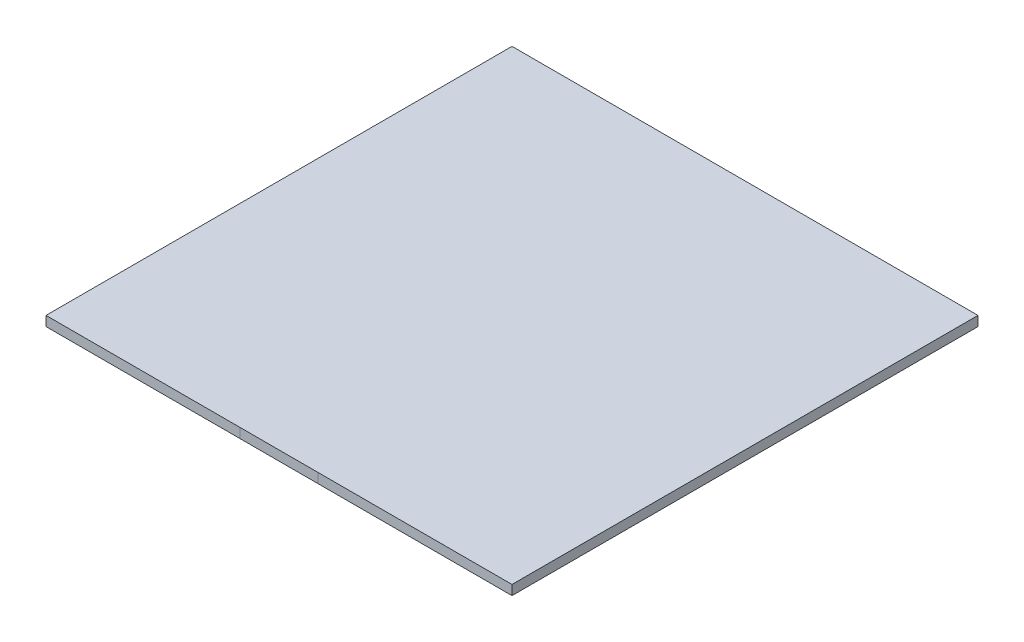
ISO-10303-21;
HEADER;
FILE_DESCRIPTION(('STEP AP214'),'2;1');
FILE_NAME('part.step','',(''),(''),'','','');
FILE_SCHEMA(('AUTOMOTIVE_DESIGN { 1 0 10303 214 1 1 1 1 }'));
ENDSEC;
DATA;
#1=APPLICATION_CONTEXT('core data for automotive mechanical design processes');
#2=APPLICATION_PROTOCOL_DEFINITION('international standard','automotive_design',2000,#1);
#3=PRODUCT_CONTEXT('',#1,'mechanical');
#4=PRODUCT('Part','Part','',(#3));
#5=PRODUCT_RELATED_PRODUCT_CATEGORY('part','',(#4));
#6=PRODUCT_DEFINITION_FORMATION('','',#4);
#7=PRODUCT_DEFINITION_CONTEXT('part definition',#1,'design');
#8=PRODUCT_DEFINITION('design','',#6,#7);
#9=PRODUCT_DEFINITION_SHAPE('','',#8);
#10=(LENGTH_UNIT() NAMED_UNIT(*) SI_UNIT(.MILLI.,.METRE.));
#11=(NAMED_UNIT(*) PLANE_ANGLE_UNIT() SI_UNIT($,.RADIAN.));
#12=(NAMED_UNIT(*) SI_UNIT($,.STERADIAN.) SOLID_ANGLE_UNIT());
#13=UNCERTAINTY_MEASURE_WITH_UNIT(LENGTH_MEASURE(1.E-05),#10,'distance_accuracy_value','');
#14=(GEOMETRIC_REPRESENTATION_CONTEXT(3) GLOBAL_UNCERTAINTY_ASSIGNED_CONTEXT((#13)) GLOBAL_UNIT_ASSIGNED_CONTEXT((#10,
#11,#12)) REPRESENTATION_CONTEXT('',''));
#15=CARTESIAN_POINT('',(0.,0.,0.));
#16=DIRECTION('',(0.,0.,1.));
#17=DIRECTION('',(1.,0.,0.));
#18=AXIS2_PLACEMENT_3D('',#15,#16,#17);
#19=CARTESIAN_POINT('',(0.,0.,152.4));
#20=DIRECTION('',(0.,0.,1.));
#21=DIRECTION('',(1.,0.,0.));
#22=AXIS2_PLACEMENT_3D('',#19,#20,#21);
#23=PLANE('',#22);
#24=DIRECTION('',(1.,0.,0.));
#25=VECTOR('',#24,1.);
#26=CARTESIAN_POINT('',(0.,-3.175,152.4));
#27=LINE('',#26,#25);
#28=CARTESIAN_POINT('',(0.,-3.175,152.4));
#29=VERTEX_POINT('',#28);
#30=CARTESIAN_POINT('',(63.5,-3.175,152.4));
#31=VERTEX_POINT('',#30);
#32=EDGE_CURVE('E92',#29,#31,#27,.T.);
#33=ORIENTED_EDGE('',*,*,#32,.T.);
#34=DIRECTION('',(0.,1.,0.));
#35=VECTOR('',#34,1.);
#36=CARTESIAN_POINT('',(63.5,0.,152.4));
#37=LINE('',#36,#35);
#38=CARTESIAN_POINT('',(63.5,0.,152.4));
#39=VERTEX_POINT('',#38);
#40=EDGE_CURVE('E12',#31,#39,#37,.T.);
#41=ORIENTED_EDGE('',*,*,#40,.T.);
#42=DIRECTION('',(-1.,0.,0.));
#43=VECTOR('',#42,1.);
#44=CARTESIAN_POINT('',(0.,0.,152.4));
#45=LINE('',#44,#43);
#46=CARTESIAN_POINT('',(0.,0.,152.4));
#47=VERTEX_POINT('',#46);
#48=EDGE_CURVE('E105',#39,#47,#45,.T.);
#49=ORIENTED_EDGE('',*,*,#48,.T.);
#50=DIRECTION('',(0.,-1.,0.));
#51=VECTOR('',#50,1.);
#52=CARTESIAN_POINT('',(0.,0.,152.4));
#53=LINE('',#52,#51);
#54=EDGE_CURVE('E104',#47,#29,#53,.T.);
#55=ORIENTED_EDGE('',*,*,#54,.T.);
#56=EDGE_LOOP('',(#33,#41,#49,#55));
#57=FACE_BOUND('',#56,.T.);
#58=ADVANCED_FACE('F40',(#57),#23,.T.);
#59=CARTESIAN_POINT('',(152.4,0.,152.4));
#60=VERTEX_POINT('',#59);
#61=CARTESIAN_POINT('',(88.9,0.,152.4));
#62=VERTEX_POINT('',#61);
#63=EDGE_CURVE('E124',#60,#62,#45,.T.);
#64=ORIENTED_EDGE('',*,*,#63,.T.);
#65=DIRECTION('',(0.,-1.,0.));
#66=VECTOR('',#65,1.);
#67=CARTESIAN_POINT('',(88.9,0.,152.4));
#68=LINE('',#67,#66);
#69=CARTESIAN_POINT('',(88.9,-3.175,152.4));
#70=VERTEX_POINT('',#69);
#71=EDGE_CURVE('E49',#62,#70,#68,.T.);
#72=ORIENTED_EDGE('',*,*,#71,.T.);
#73=CARTESIAN_POINT('',(152.4,-3.175,152.4));
#74=VERTEX_POINT('',#73);
#75=EDGE_CURVE('E102',#70,#74,#27,.T.);
#76=ORIENTED_EDGE('',*,*,#75,.T.);
#77=DIRECTION('',(0.,1.,0.));
#78=VECTOR('',#77,1.);
#79=CARTESIAN_POINT('',(152.4,0.,152.4));
#80=LINE('',#79,#78);
#81=EDGE_CURVE('E100',#74,#60,#80,.T.);
#82=ORIENTED_EDGE('',*,*,#81,.T.);
#83=EDGE_LOOP('',(#64,#72,#76,#82));
#84=FACE_BOUND('',#83,.T.);
#85=ADVANCED_FACE('F141',(#84),#23,.T.);
#86=CARTESIAN_POINT('',(0.,0.,152.4));
#87=DIRECTION('',(1.,0.,0.));
#88=DIRECTION('',(0.,1.,0.));
#89=AXIS2_PLACEMENT_3D('',#86,#87,#88);
#90=PLANE('',#89);
#91=DIRECTION('',(0.,-1.,0.));
#92=VECTOR('',#91,1.);
#93=CARTESIAN_POINT('',(0.,0.,0.));
#94=LINE('',#93,#92);
#95=CARTESIAN_POINT('',(0.,0.,0.));
#96=VERTEX_POINT('',#95);
#97=CARTESIAN_POINT('',(0.,-3.175,0.));
#98=VERTEX_POINT('',#97);
#99=EDGE_CURVE('E112',#96,#98,#94,.T.);
#100=ORIENTED_EDGE('',*,*,#99,.T.);
#101=DIRECTION('',(0.,0.,-1.));
#102=VECTOR('',#101,1.);
#103=CARTESIAN_POINT('',(0.,-3.175,152.4));
#104=LINE('',#103,#102);
#105=EDGE_CURVE('E96',#29,#98,#104,.T.);
#106=ORIENTED_EDGE('',*,*,#105,.F.);
#107=ORIENTED_EDGE('',*,*,#54,.F.);
#108=DIRECTION('',(0.,0.,-1.));
#109=VECTOR('',#108,1.);
#110=CARTESIAN_POINT('',(0.,0.,152.4));
#111=LINE('',#110,#109);
#112=EDGE_CURVE('E122',#47,#96,#111,.T.);
#113=ORIENTED_EDGE('',*,*,#112,.T.);
#114=EDGE_LOOP('',(#100,#106,#107,#113));
#115=FACE_BOUND('',#114,.T.);
#116=ADVANCED_FACE('F42',(#115),#90,.F.);
#117=CARTESIAN_POINT('',(0.,-3.175,152.4));
#118=DIRECTION('',(0.,1.,0.));
#119=DIRECTION('',(0.,0.,1.));
#120=AXIS2_PLACEMENT_3D('',#117,#118,#119);
#121=PLANE('',#120);
#122=DIRECTION('',(1.,0.,0.));
#123=VECTOR('',#122,1.);
#124=CARTESIAN_POINT('',(0.,-3.175,0.));
#125=LINE('',#124,#123);
#126=CARTESIAN_POINT('',(152.4,-3.175,0.));
#127=VERTEX_POINT('',#126);
#128=EDGE_CURVE('E128',#98,#127,#125,.T.);
#129=ORIENTED_EDGE('',*,*,#128,.T.);
#130=DIRECTION('',(0.,0.,-1.));
#131=VECTOR('',#130,1.);
#132=CARTESIAN_POINT('',(152.4,-3.175,152.4));
#133=LINE('',#132,#131);
#134=EDGE_CURVE('E113',#74,#127,#133,.T.);
#135=ORIENTED_EDGE('',*,*,#134,.F.);
#136=ORIENTED_EDGE('',*,*,#75,.F.);
#137=EDGE_CURVE('E99',#31,#70,#27,.T.);
#138=ORIENTED_EDGE('',*,*,#137,.F.);
#139=ORIENTED_EDGE('',*,*,#32,.F.);
#140=ORIENTED_EDGE('',*,*,#105,.T.);
#141=EDGE_LOOP('',(#129,#135,#136,#138,#139,#140));
#142=FACE_BOUND('',#141,.T.);
#143=ADVANCED_FACE('F94',(#142),#121,.F.);
#144=CARTESIAN_POINT('',(152.4,0.,152.4));
#145=DIRECTION('',(-1.,0.,0.));
#146=DIRECTION('',(0.,0.,1.));
#147=AXIS2_PLACEMENT_3D('',#144,#145,#146);
#148=PLANE('',#147);
#149=DIRECTION('',(0.,1.,0.));
#150=VECTOR('',#149,1.);
#151=CARTESIAN_POINT('',(152.4,0.,0.));
#152=LINE('',#151,#150);
#153=CARTESIAN_POINT('',(152.4,0.,0.));
#154=VERTEX_POINT('',#153);
#155=EDGE_CURVE('E126',#127,#154,#152,.T.);
#156=ORIENTED_EDGE('',*,*,#155,.T.);
#157=DIRECTION('',(0.,0.,-1.));
#158=VECTOR('',#157,1.);
#159=CARTESIAN_POINT('',(152.4,0.,152.4));
#160=LINE('',#159,#158);
#161=EDGE_CURVE('E117',#60,#154,#160,.T.);
#162=ORIENTED_EDGE('',*,*,#161,.F.);
#163=ORIENTED_EDGE('',*,*,#81,.F.);
#164=ORIENTED_EDGE('',*,*,#134,.T.);
#165=EDGE_LOOP('',(#156,#162,#163,#164));
#166=FACE_BOUND('',#165,.T.);
#167=ADVANCED_FACE('F145',(#166),#148,.F.);
#168=CARTESIAN_POINT('',(0.,0.,152.4));
#169=DIRECTION('',(0.,-1.,0.));
#170=DIRECTION('',(0.,0.,-1.));
#171=AXIS2_PLACEMENT_3D('',#168,#169,#170);
#172=PLANE('',#171);
#173=DIRECTION('',(-1.,0.,0.));
#174=VECTOR('',#173,1.);
#175=CARTESIAN_POINT('',(0.,0.,0.));
#176=LINE('',#175,#174);
#177=EDGE_CURVE('E109',#154,#96,#176,.T.);
#178=ORIENTED_EDGE('',*,*,#177,.T.);
#179=ORIENTED_EDGE('',*,*,#112,.F.);
#180=ORIENTED_EDGE('',*,*,#48,.F.);
#181=EDGE_CURVE('E133',#62,#39,#45,.T.);
#182=ORIENTED_EDGE('',*,*,#181,.F.);
#183=ORIENTED_EDGE('',*,*,#63,.F.);
#184=ORIENTED_EDGE('',*,*,#161,.T.);
#185=EDGE_LOOP('',(#178,#179,#180,#182,#183,#184));
#186=FACE_BOUND('',#185,.T.);
#187=ADVANCED_FACE('F140',(#186),#172,.F.);
#188=ORIENTED_EDGE('',*,*,#40,.F.);
#189=ORIENTED_EDGE('',*,*,#137,.T.);
#190=ORIENTED_EDGE('',*,*,#71,.F.);
#191=ORIENTED_EDGE('',*,*,#181,.T.);
#192=EDGE_LOOP('',(#188,#189,#190,#191));
#193=FACE_BOUND('',#192,.T.);
#194=ADVANCED_FACE('F137',(#193),#23,.T.);
#195=CARTESIAN_POINT('',(0.,0.,0.));
#196=DIRECTION('',(0.,0.,1.));
#197=DIRECTION('',(1.,0.,0.));
#198=AXIS2_PLACEMENT_3D('',#195,#196,#197);
#199=PLANE('',#198);
#200=ORIENTED_EDGE('',*,*,#99,.F.);
#201=ORIENTED_EDGE('',*,*,#177,.F.);
#202=ORIENTED_EDGE('',*,*,#155,.F.);
#203=ORIENTED_EDGE('',*,*,#128,.F.);
#204=EDGE_LOOP('',(#200,#201,#202,#203));
#205=FACE_BOUND('',#204,.T.);
#206=ADVANCED_FACE('F148',(#205),#199,.F.);
#207=CLOSED_SHELL('',(#58,#85,#116,#143,#167,#187,#194,#206));
#208=MANIFOLD_SOLID_BREP('B2',#207);
#209=ADVANCED_BREP_SHAPE_REPRESENTATION('',(#18,#208),#14);
#210=SHAPE_DEFINITION_REPRESENTATION(#9,#209);
ENDSEC;
END-ISO-10303-21;
